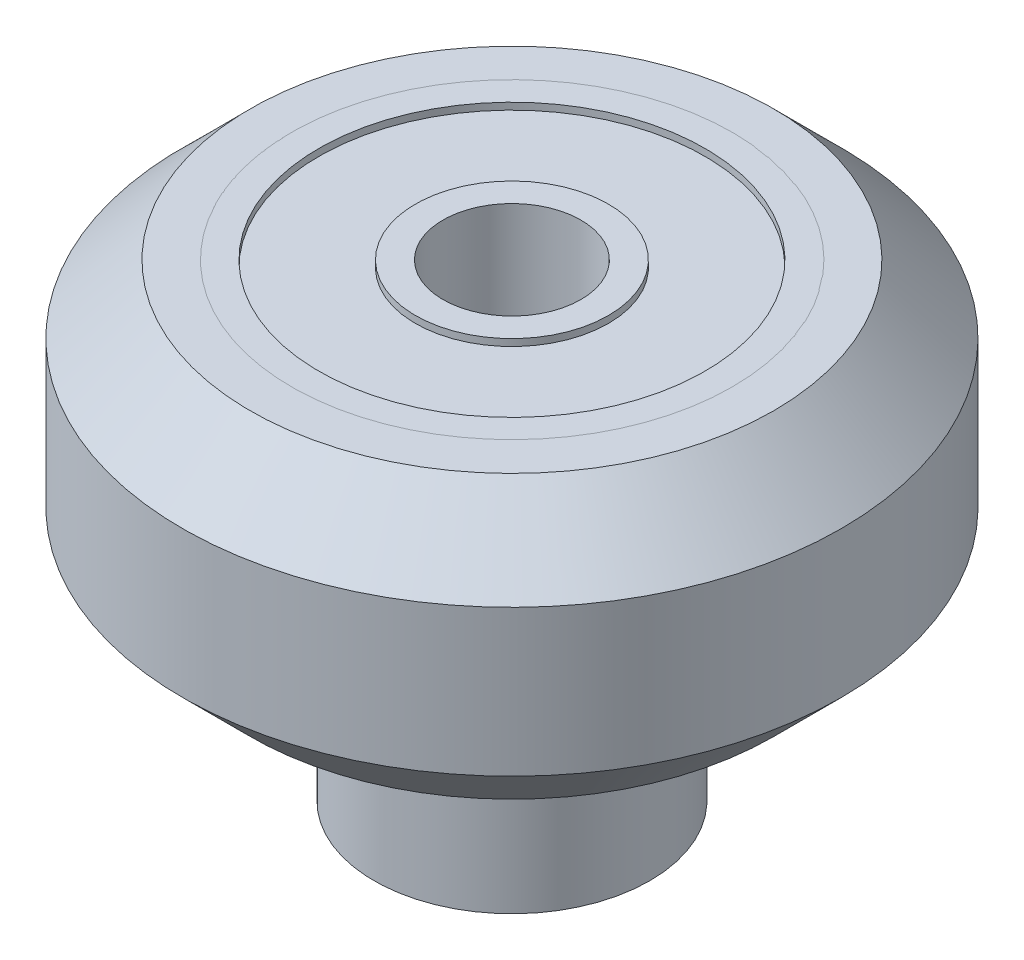
ISO-10303-21;
HEADER;
FILE_DESCRIPTION(('STEP AP214'),'2;1');
FILE_NAME('part.step','',(''),(''),'','','');
FILE_SCHEMA(('AUTOMOTIVE_DESIGN { 1 0 10303 214 1 1 1 1 }'));
ENDSEC;
DATA;
#1=APPLICATION_CONTEXT('core data for automotive mechanical design processes');
#2=APPLICATION_PROTOCOL_DEFINITION('international standard','automotive_design',2000,#1);
#3=PRODUCT_CONTEXT('',#1,'mechanical');
#4=PRODUCT('Part','Part','',(#3));
#5=PRODUCT_RELATED_PRODUCT_CATEGORY('part','',(#4));
#6=PRODUCT_DEFINITION_FORMATION('','',#4);
#7=PRODUCT_DEFINITION_CONTEXT('part definition',#1,'design');
#8=PRODUCT_DEFINITION('design','',#6,#7);
#9=PRODUCT_DEFINITION_SHAPE('','',#8);
#10=(LENGTH_UNIT() NAMED_UNIT(*) SI_UNIT(.MILLI.,.METRE.));
#11=(NAMED_UNIT(*) PLANE_ANGLE_UNIT() SI_UNIT($,.RADIAN.));
#12=(NAMED_UNIT(*) SI_UNIT($,.STERADIAN.) SOLID_ANGLE_UNIT());
#13=UNCERTAINTY_MEASURE_WITH_UNIT(LENGTH_MEASURE(1.E-05),#10,'distance_accuracy_value','');
#14=(GEOMETRIC_REPRESENTATION_CONTEXT(3) GLOBAL_UNCERTAINTY_ASSIGNED_CONTEXT((#13)) GLOBAL_UNIT_ASSIGNED_CONTEXT((#10,
#11,#12)) REPRESENTATION_CONTEXT('',''));
#15=CARTESIAN_POINT('',(0.,0.,0.));
#16=DIRECTION('',(0.,0.,1.));
#17=DIRECTION('',(1.,0.,0.));
#18=AXIS2_PLACEMENT_3D('',#15,#16,#17);
#19=CARTESIAN_POINT('',(-15.269501468331,-6.671026253248,2.998759293101));
#20=DIRECTION('',(0.,1.,0.));
#21=DIRECTION('',(-1.,0.,0.));
#22=AXIS2_PLACEMENT_3D('',#19,#20,#21);
#23=CYLINDRICAL_SURFACE('',#22,2.55);
#24=CARTESIAN_POINT('',(-15.269501468331,-12.671026253248,2.998759293101));
#25=DIRECTION('',(0.,1.,0.));
#26=DIRECTION('',(-1.,0.,0.));
#27=AXIS2_PLACEMENT_3D('',#24,#25,#26);
#28=CIRCLE('',#27,2.55);
#29=CARTESIAN_POINT('',(-12.719501468331,-12.671026253248,2.998759293101));
#30=VERTEX_POINT('',#29);
#31=EDGE_CURVE('P0_E31',#30,#30,#28,.T.);
#32=ORIENTED_EDGE('',*,*,#31,.F.);
#33=EDGE_LOOP('',(#32));
#34=FACE_BOUND('',#33,.T.);
#35=CARTESIAN_POINT('',(-15.269501468331,-6.671026253248,2.998759293101));
#36=DIRECTION('',(0.,-1.,0.));
#37=DIRECTION('',(-1.,0.,0.));
#38=AXIS2_PLACEMENT_3D('',#35,#36,#37);
#39=CIRCLE('',#38,2.55);
#40=CARTESIAN_POINT('',(-12.719501468331,-6.671026253248,2.998759293101));
#41=VERTEX_POINT('',#40);
#42=EDGE_CURVE('P0_E10',#41,#41,#39,.T.);
#43=ORIENTED_EDGE('',*,*,#42,.F.);
#44=EDGE_LOOP('',(#43));
#45=FACE_BOUND('',#44,.T.);
#46=ADVANCED_FACE('P0_F16',(#34,#45),#23,.F.);
#47=CARTESIAN_POINT('',(-15.269501468331,-6.671026253248,2.998759293101));
#48=DIRECTION('',(0.,1.,0.));
#49=DIRECTION('',(-1.,0.,0.));
#50=AXIS2_PLACEMENT_3D('',#47,#48,#49);
#51=CYLINDRICAL_SURFACE('',#50,5.);
#52=CARTESIAN_POINT('',(-15.269501468331,-12.671026253248,2.998759293101));
#53=DIRECTION('',(0.,-1.,0.));
#54=DIRECTION('',(-1.,0.,0.));
#55=AXIS2_PLACEMENT_3D('',#52,#53,#54);
#56=CIRCLE('',#55,5.);
#57=CARTESIAN_POINT('',(-10.269501468331,-12.671026253248,2.99875929310101));
#58=VERTEX_POINT('',#57);
#59=EDGE_CURVE('P0_E38',#58,#58,#56,.T.);
#60=ORIENTED_EDGE('',*,*,#59,.F.);
#61=EDGE_LOOP('',(#60));
#62=FACE_BOUND('',#61,.T.);
#63=CARTESIAN_POINT('',(-15.269501468331,-6.671026253248,2.998759293101));
#64=DIRECTION('',(0.,1.,0.));
#65=DIRECTION('',(-1.,0.,0.));
#66=AXIS2_PLACEMENT_3D('',#63,#64,#65);
#67=CIRCLE('',#66,5.);
#68=CARTESIAN_POINT('',(-10.269501468331,-6.671026253248,2.99875929310101));
#69=VERTEX_POINT('',#68);
#70=EDGE_CURVE('P0_E25',#69,#69,#67,.T.);
#71=ORIENTED_EDGE('',*,*,#70,.F.);
#72=EDGE_LOOP('',(#71));
#73=FACE_BOUND('',#72,.T.);
#74=ADVANCED_FACE('P0_F42',(#62,#73),#51,.T.);
#75=CARTESIAN_POINT('',(-15.269501468331,-6.671026253248,2.998759293101));
#76=DIRECTION('',(0.,-1.,0.));
#77=DIRECTION('',(1.,0.,0.));
#78=AXIS2_PLACEMENT_3D('',#75,#76,#77);
#79=PLANE('',#78);
#80=ORIENTED_EDGE('',*,*,#42,.T.);
#81=EDGE_LOOP('',(#80));
#82=FACE_BOUND('',#81,.T.);
#83=ORIENTED_EDGE('',*,*,#70,.T.);
#84=EDGE_LOOP('',(#83));
#85=FACE_BOUND('',#84,.T.);
#86=ADVANCED_FACE('P0_F18',(#82,#85),#79,.F.);
#87=CARTESIAN_POINT('',(-15.269501468331,-12.671026253248,2.998759293101));
#88=DIRECTION('',(0.,-1.,0.));
#89=DIRECTION('',(1.,0.,0.));
#90=AXIS2_PLACEMENT_3D('',#87,#88,#89);
#91=PLANE('',#90);
#92=ORIENTED_EDGE('',*,*,#31,.T.);
#93=EDGE_LOOP('',(#92));
#94=FACE_BOUND('',#93,.T.);
#95=ORIENTED_EDGE('',*,*,#59,.T.);
#96=EDGE_LOOP('',(#95));
#97=FACE_BOUND('',#96,.T.);
#98=ADVANCED_FACE('P0_F47',(#94,#97),#91,.T.);
#99=CLOSED_SHELL('',(#46,#74,#86,#98));
#100=MANIFOLD_SOLID_BREP('P0_B1',#99);
#101=CARTESIAN_POINT('',(-15.269501468331,-0.786026253248,2.998759293101));
#102=DIRECTION('',(0.,1.,0.));
#103=DIRECTION('',(1.,0.,0.));
#104=AXIS2_PLACEMENT_3D('',#101,#102,#103);
#105=CYLINDRICAL_SURFACE('',#104,7.987);
#106=CARTESIAN_POINT('',(-15.269501468331,-5.901026253248,2.998759293101));
#107=DIRECTION('',(0.,-1.,0.));
#108=DIRECTION('',(1.,0.,0.));
#109=AXIS2_PLACEMENT_3D('',#106,#107,#108);
#110=CIRCLE('',#109,7.987);
#111=CARTESIAN_POINT('',(-7.282501468331,-5.901026253248,2.998759293101));
#112=VERTEX_POINT('',#111);
#113=EDGE_CURVE('P1_E11',#112,#112,#110,.T.);
#114=ORIENTED_EDGE('',*,*,#113,.T.);
#115=EDGE_LOOP('',(#114));
#116=FACE_BOUND('',#115,.T.);
#117=CARTESIAN_POINT('',(-15.269501468331,4.328973746752,2.998759293101));
#118=DIRECTION('',(0.,-1.,0.));
#119=DIRECTION('',(1.,0.,0.));
#120=AXIS2_PLACEMENT_3D('',#117,#118,#119);
#121=CIRCLE('',#120,7.987);
#122=CARTESIAN_POINT('',(-7.282501468331,4.328973746752,2.998759293101));
#123=VERTEX_POINT('',#122);
#124=EDGE_CURVE('P1_E27',#123,#123,#121,.T.);
#125=ORIENTED_EDGE('',*,*,#124,.F.);
#126=EDGE_LOOP('',(#125));
#127=FACE_BOUND('',#126,.T.);
#128=ADVANCED_FACE('P1_F17',(#116,#127),#105,.F.);
#129=CARTESIAN_POINT('',(-5.782501468331,4.328973746752,2.998759293101));
#130=DIRECTION('',(0.,1.,0.));
#131=DIRECTION('',(0.,0.,1.));
#132=AXIS2_PLACEMENT_3D('',#129,#130,#131);
#133=PLANE('',#132);
#134=ORIENTED_EDGE('',*,*,#124,.T.);
#135=EDGE_LOOP('',(#134));
#136=FACE_BOUND('',#135,.T.);
#137=CARTESIAN_POINT('',(-15.269501468331,4.328973746752,2.998759293101));
#138=DIRECTION('',(0.,-1.,0.));
#139=DIRECTION('',(1.,0.,0.));
#140=AXIS2_PLACEMENT_3D('',#137,#138,#139);
#141=CIRCLE('',#140,9.487);
#142=CARTESIAN_POINT('',(-5.782501468331,4.328973746752,2.998759293101));
#143=VERTEX_POINT('',#142);
#144=EDGE_CURVE('P1_E50',#143,#143,#141,.T.);
#145=ORIENTED_EDGE('',*,*,#144,.F.);
#146=EDGE_LOOP('',(#145));
#147=FACE_BOUND('',#146,.T.);
#148=ADVANCED_FACE('P1_F61',(#136,#147),#133,.T.);
#149=CARTESIAN_POINT('',(-15.269501468331,3.097473746752,2.998759293101));
#150=DIRECTION('',(0.,-1.,0.));
#151=DIRECTION('',(1.,0.,0.));
#152=AXIS2_PLACEMENT_3D('',#149,#150,#151);
#153=CONICAL_SURFACE('',#152,10.7185,0.785398163397448);
#154=ORIENTED_EDGE('',*,*,#144,.T.);
#155=EDGE_LOOP('',(#154));
#156=FACE_BOUND('',#155,.T.);
#157=CARTESIAN_POINT('',(-15.269501468331,1.865973746752,2.998759293101));
#158=DIRECTION('',(0.,-1.,0.));
#159=DIRECTION('',(1.,0.,0.));
#160=AXIS2_PLACEMENT_3D('',#157,#158,#159);
#161=CIRCLE('',#160,11.95);
#162=CARTESIAN_POINT('',(-3.319501468331,1.865973746752,2.998759293101));
#163=VERTEX_POINT('',#162);
#164=EDGE_CURVE('P1_E48',#163,#163,#161,.T.);
#165=ORIENTED_EDGE('',*,*,#164,.F.);
#166=EDGE_LOOP('',(#165));
#167=FACE_BOUND('',#166,.T.);
#168=ADVANCED_FACE('P1_F19',(#156,#167),#153,.T.);
#169=CARTESIAN_POINT('',(-15.269501468331,-0.786026253248,2.998759293101));
#170=DIRECTION('',(0.,1.,0.));
#171=DIRECTION('',(1.,0.,0.));
#172=AXIS2_PLACEMENT_3D('',#169,#170,#171);
#173=CYLINDRICAL_SURFACE('',#172,11.95);
#174=ORIENTED_EDGE('',*,*,#164,.T.);
#175=EDGE_LOOP('',(#174));
#176=FACE_BOUND('',#175,.T.);
#177=CARTESIAN_POINT('',(-15.269501468331,-3.438026253248,2.998759293101));
#178=DIRECTION('',(0.,-1.,0.));
#179=DIRECTION('',(1.,0.,0.));
#180=AXIS2_PLACEMENT_3D('',#177,#178,#179);
#181=CIRCLE('',#180,11.95);
#182=CARTESIAN_POINT('',(-3.319501468331,-3.438026253248,2.998759293101));
#183=VERTEX_POINT('',#182);
#184=EDGE_CURVE('P1_E45',#183,#183,#181,.T.);
#185=ORIENTED_EDGE('',*,*,#184,.F.);
#186=EDGE_LOOP('',(#185));
#187=FACE_BOUND('',#186,.T.);
#188=ADVANCED_FACE('P1_F46',(#176,#187),#173,.T.);
#189=CARTESIAN_POINT('',(-15.269501468331,-4.669526253248,2.998759293101));
#190=DIRECTION('',(0.,1.,0.));
#191=DIRECTION('',(1.,0.,0.));
#192=AXIS2_PLACEMENT_3D('',#189,#190,#191);
#193=CONICAL_SURFACE('',#192,10.7185,0.785398163397448);
#194=ORIENTED_EDGE('',*,*,#184,.T.);
#195=EDGE_LOOP('',(#194));
#196=FACE_BOUND('',#195,.T.);
#197=CARTESIAN_POINT('',(-15.269501468331,-5.901026253248,2.998759293101));
#198=DIRECTION('',(0.,-1.,0.));
#199=DIRECTION('',(1.,0.,0.));
#200=AXIS2_PLACEMENT_3D('',#197,#198,#199);
#201=CIRCLE('',#200,9.487);
#202=CARTESIAN_POINT('',(-5.782501468331,-5.901026253248,2.998759293101));
#203=VERTEX_POINT('',#202);
#204=EDGE_CURVE('P1_E21',#203,#203,#201,.T.);
#205=ORIENTED_EDGE('',*,*,#204,.F.);
#206=EDGE_LOOP('',(#205));
#207=FACE_BOUND('',#206,.T.);
#208=ADVANCED_FACE('P1_F75',(#196,#207),#193,.T.);
#209=CARTESIAN_POINT('',(-7.282501468331,-5.901026253248,2.998759293101));
#210=DIRECTION('',(0.,-1.,0.));
#211=DIRECTION('',(0.,0.,-1.));
#212=AXIS2_PLACEMENT_3D('',#209,#210,#211);
#213=PLANE('',#212);
#214=ORIENTED_EDGE('',*,*,#204,.T.);
#215=EDGE_LOOP('',(#214));
#216=FACE_BOUND('',#215,.T.);
#217=ORIENTED_EDGE('',*,*,#113,.F.);
#218=EDGE_LOOP('',(#217));
#219=FACE_BOUND('',#218,.T.);
#220=ADVANCED_FACE('P1_F78',(#216,#219),#213,.T.);
#221=CLOSED_SHELL('',(#128,#148,#168,#188,#208,#220));
#222=MANIFOLD_SOLID_BREP('P1_B1',#221);
#223=CARTESIAN_POINT('',(-15.269501468331,-5.671026253248,2.998759293101));
#224=DIRECTION('',(0.,1.,0.));
#225=DIRECTION('',(-1.,0.,0.));
#226=AXIS2_PLACEMENT_3D('',#223,#224,#225);
#227=CYLINDRICAL_SURFACE('',#226,2.5);
#228=CARTESIAN_POINT('',(-15.269501468331,-6.671026253248,2.998759293101));
#229=DIRECTION('',(0.,1.,0.));
#230=DIRECTION('',(-1.,0.,0.));
#231=AXIS2_PLACEMENT_3D('',#228,#229,#230);
#232=CIRCLE('',#231,2.5);
#233=CARTESIAN_POINT('',(-12.769501468331,-6.671026253248,2.998759293101));
#234=VERTEX_POINT('',#233);
#235=EDGE_CURVE('P2_E32',#234,#234,#232,.T.);
#236=ORIENTED_EDGE('',*,*,#235,.F.);
#237=EDGE_LOOP('',(#236));
#238=FACE_BOUND('',#237,.T.);
#239=CARTESIAN_POINT('',(-15.269501468331,-5.671026253248,2.998759293101));
#240=DIRECTION('',(0.,-1.,0.));
#241=DIRECTION('',(-1.,0.,0.));
#242=AXIS2_PLACEMENT_3D('',#239,#240,#241);
#243=CIRCLE('',#242,2.5);
#244=CARTESIAN_POINT('',(-12.769501468331,-5.671026253248,2.998759293101));
#245=VERTEX_POINT('',#244);
#246=EDGE_CURVE('P2_E11',#245,#245,#243,.T.);
#247=ORIENTED_EDGE('',*,*,#246,.F.);
#248=EDGE_LOOP('',(#247));
#249=FACE_BOUND('',#248,.T.);
#250=ADVANCED_FACE('P2_F17',(#238,#249),#227,.F.);
#251=CARTESIAN_POINT('',(-15.269501468331,-5.671026253248,2.998759293101));
#252=DIRECTION('',(0.,1.,0.));
#253=DIRECTION('',(-1.,0.,0.));
#254=AXIS2_PLACEMENT_3D('',#251,#252,#253);
#255=CYLINDRICAL_SURFACE('',#254,5.);
#256=CARTESIAN_POINT('',(-15.269501468331,-6.671026253248,2.998759293101));
#257=DIRECTION('',(0.,-1.,0.));
#258=DIRECTION('',(-1.,0.,0.));
#259=AXIS2_PLACEMENT_3D('',#256,#257,#258);
#260=CIRCLE('',#259,5.);
#261=CARTESIAN_POINT('',(-10.269501468331,-6.671026253248,2.998759293101));
#262=VERTEX_POINT('',#261);
#263=EDGE_CURVE('P2_E39',#262,#262,#260,.T.);
#264=ORIENTED_EDGE('',*,*,#263,.F.);
#265=EDGE_LOOP('',(#264));
#266=FACE_BOUND('',#265,.T.);
#267=CARTESIAN_POINT('',(-15.269501468331,-5.671026253248,2.998759293101));
#268=DIRECTION('',(0.,1.,0.));
#269=DIRECTION('',(-1.,0.,0.));
#270=AXIS2_PLACEMENT_3D('',#267,#268,#269);
#271=CIRCLE('',#270,5.);
#272=CARTESIAN_POINT('',(-10.269501468331,-5.671026253248,2.998759293101));
#273=VERTEX_POINT('',#272);
#274=EDGE_CURVE('P2_E26',#273,#273,#271,.T.);
#275=ORIENTED_EDGE('',*,*,#274,.F.);
#276=EDGE_LOOP('',(#275));
#277=FACE_BOUND('',#276,.T.);
#278=ADVANCED_FACE('P2_F43',(#266,#277),#255,.T.);
#279=CARTESIAN_POINT('',(-15.269501468331,-5.671026253248,2.998759293101));
#280=DIRECTION('',(0.,-1.,0.));
#281=DIRECTION('',(1.,0.,0.));
#282=AXIS2_PLACEMENT_3D('',#279,#280,#281);
#283=PLANE('',#282);
#284=ORIENTED_EDGE('',*,*,#246,.T.);
#285=EDGE_LOOP('',(#284));
#286=FACE_BOUND('',#285,.T.);
#287=ORIENTED_EDGE('',*,*,#274,.T.);
#288=EDGE_LOOP('',(#287));
#289=FACE_BOUND('',#288,.T.);
#290=ADVANCED_FACE('P2_F19',(#286,#289),#283,.F.);
#291=CARTESIAN_POINT('',(-15.269501468331,-6.671026253248,2.998759293101));
#292=DIRECTION('',(0.,-1.,0.));
#293=DIRECTION('',(1.,0.,0.));
#294=AXIS2_PLACEMENT_3D('',#291,#292,#293);
#295=PLANE('',#294);
#296=ORIENTED_EDGE('',*,*,#235,.T.);
#297=EDGE_LOOP('',(#296));
#298=FACE_BOUND('',#297,.T.);
#299=ORIENTED_EDGE('',*,*,#263,.T.);
#300=EDGE_LOOP('',(#299));
#301=FACE_BOUND('',#300,.T.);
#302=ADVANCED_FACE('P2_F48',(#298,#301),#295,.T.);
#303=CLOSED_SHELL('',(#250,#278,#290,#302));
#304=MANIFOLD_SOLID_BREP('P2_B1',#303);
#305=CARTESIAN_POINT('',(-12.41701713586,4.328973746752,0.97062390979753));
#306=DIRECTION('',(0.,1.,0.));
#307=DIRECTION('',(0.57946725237242,0.,0.814995523563141));
#308=AXIS2_PLACEMENT_3D('',#305,#306,#307);
#309=PLANE('',#308);
#310=CARTESIAN_POINT('',(-15.269501468331,4.328973746752,2.998759293101));
#311=DIRECTION('',(0.,-1.,0.));
#312=DIRECTION('',(0.57946725237242,0.,0.814995523563141));
#313=AXIS2_PLACEMENT_3D('',#310,#311,#312);
#314=CIRCLE('',#313,3.5);
#315=CARTESIAN_POINT('',(-12.41701713586,4.328973746752,0.97062390979753));
#316=VERTEX_POINT('',#315);
#317=EDGE_CURVE('P3_E27',#316,#316,#314,.T.);
#318=ORIENTED_EDGE('',*,*,#317,.F.);
#319=EDGE_LOOP('',(#318));
#320=FACE_BOUND('',#319,.T.);
#321=CARTESIAN_POINT('',(-15.269501468331,4.328973746752,2.998759293101));
#322=DIRECTION('',(0.,-1.,0.));
#323=DIRECTION('',(0.57946725237242,0.,0.814995523563141));
#324=AXIS2_PLACEMENT_3D('',#321,#322,#323);
#325=CIRCLE('',#324,2.5);
#326=CARTESIAN_POINT('',(-13.2320126594231,4.328973746752,1.55009116216995));
#327=VERTEX_POINT('',#326);
#328=EDGE_CURVE('P3_E11',#327,#327,#325,.T.);
#329=ORIENTED_EDGE('',*,*,#328,.T.);
#330=EDGE_LOOP('',(#329));
#331=FACE_BOUND('',#330,.T.);
#332=ADVANCED_FACE('P3_F17',(#320,#331),#309,.T.);
#333=CARTESIAN_POINT('',(-15.269501468331,4.203973746752,2.998759293101));
#334=DIRECTION('',(0.,1.,0.));
#335=DIRECTION('',(0.814995523563141,0.,-0.57946725237242));
#336=AXIS2_PLACEMENT_3D('',#333,#334,#335);
#337=CYLINDRICAL_SURFACE('',#336,3.5);
#338=CARTESIAN_POINT('',(-15.269501468331,4.078973746752,2.998759293101));
#339=DIRECTION('',(0.,-1.,0.));
#340=DIRECTION('',(0.57946725237242,0.,0.814995523563141));
#341=AXIS2_PLACEMENT_3D('',#338,#339,#340);
#342=CIRCLE('',#341,3.5);
#343=CARTESIAN_POINT('',(-12.41701713586,4.078973746752,0.97062390979753));
#344=VERTEX_POINT('',#343);
#345=EDGE_CURVE('P3_E89',#344,#344,#342,.T.);
#346=ORIENTED_EDGE('',*,*,#345,.F.);
#347=EDGE_LOOP('',(#346));
#348=FACE_BOUND('',#347,.T.);
#349=ORIENTED_EDGE('',*,*,#317,.T.);
#350=EDGE_LOOP('',(#349));
#351=FACE_BOUND('',#350,.T.);
#352=ADVANCED_FACE('P3_F110',(#348,#351),#337,.T.);
#353=CARTESIAN_POINT('',(-9.56453280338901,4.078973746752,-1.05751147350594));
#354=DIRECTION('',(0.,1.,0.));
#355=DIRECTION('',(0.57946725237242,0.,0.814995523563141));
#356=AXIS2_PLACEMENT_3D('',#353,#354,#355);
#357=PLANE('',#356);
#358=CARTESIAN_POINT('',(-15.269501468331,4.078973746752,2.998759293101));
#359=DIRECTION('',(0.,-1.,0.));
#360=DIRECTION('',(0.57946725237242,0.,0.814995523563141));
#361=AXIS2_PLACEMENT_3D('',#358,#359,#360);
#362=CIRCLE('',#361,7.);
#363=CARTESIAN_POINT('',(-9.56453280338901,4.078973746752,-1.05751147350594));
#364=VERTEX_POINT('',#363);
#365=EDGE_CURVE('P3_E86',#364,#364,#362,.T.);
#366=ORIENTED_EDGE('',*,*,#365,.F.);
#367=EDGE_LOOP('',(#366));
#368=FACE_BOUND('',#367,.T.);
#369=ORIENTED_EDGE('',*,*,#345,.T.);
#370=EDGE_LOOP('',(#369));
#371=FACE_BOUND('',#370,.T.);
#372=ADVANCED_FACE('P3_F19',(#368,#371),#357,.T.);
#373=CARTESIAN_POINT('',(-15.269501468331,4.203973746752,2.998759293101));
#374=DIRECTION('',(0.,1.,0.));
#375=DIRECTION('',(0.814995523563141,0.,-0.57946725237242));
#376=AXIS2_PLACEMENT_3D('',#373,#374,#375);
#377=CYLINDRICAL_SURFACE('',#376,7.);
#378=CARTESIAN_POINT('',(-15.269501468331,4.328973746752,2.998759293101));
#379=DIRECTION('',(0.,-1.,0.));
#380=DIRECTION('',(0.57946725237242,0.,0.814995523563141));
#381=AXIS2_PLACEMENT_3D('',#378,#379,#380);
#382=CIRCLE('',#381,7.);
#383=CARTESIAN_POINT('',(-9.56453280338901,4.328973746752,-1.05751147350594));
#384=VERTEX_POINT('',#383);
#385=EDGE_CURVE('P3_E84',#384,#384,#382,.T.);
#386=ORIENTED_EDGE('',*,*,#385,.F.);
#387=EDGE_LOOP('',(#386));
#388=FACE_BOUND('',#387,.T.);
#389=ORIENTED_EDGE('',*,*,#365,.T.);
#390=EDGE_LOOP('',(#389));
#391=FACE_BOUND('',#390,.T.);
#392=ADVANCED_FACE('P3_F98',(#388,#391),#377,.F.);
#393=CARTESIAN_POINT('',(-8.74953727982587,4.328973746752,-1.63697872587836));
#394=DIRECTION('',(0.,1.,0.));
#395=DIRECTION('',(0.57946725237242,0.,0.814995523563141));
#396=AXIS2_PLACEMENT_3D('',#393,#394,#395);
#397=PLANE('',#396);
#398=CARTESIAN_POINT('',(-15.269501468331,4.328973746752,2.998759293101));
#399=DIRECTION('',(0.,-1.,0.));
#400=DIRECTION('',(0.57946725237242,0.,0.814995523563141));
#401=AXIS2_PLACEMENT_3D('',#398,#399,#400);
#402=CIRCLE('',#401,8.);
#403=CARTESIAN_POINT('',(-8.74953727982587,4.328973746752,-1.63697872587836));
#404=VERTEX_POINT('',#403);
#405=EDGE_CURVE('P3_E70',#404,#404,#402,.T.);
#406=ORIENTED_EDGE('',*,*,#405,.F.);
#407=EDGE_LOOP('',(#406));
#408=FACE_BOUND('',#407,.T.);
#409=ORIENTED_EDGE('',*,*,#385,.T.);
#410=EDGE_LOOP('',(#409));
#411=FACE_BOUND('',#410,.T.);
#412=ADVANCED_FACE('P3_F96',(#408,#411),#397,.T.);
#413=CARTESIAN_POINT('',(-15.269501468331,1.828973746752,2.998759293101));
#414=DIRECTION('',(0.,1.,0.));
#415=DIRECTION('',(0.814995523563141,0.,-0.57946725237242));
#416=AXIS2_PLACEMENT_3D('',#413,#414,#415);
#417=CYLINDRICAL_SURFACE('',#416,8.);
#418=CARTESIAN_POINT('',(-15.269501468331,-0.671026253247998,2.998759293101));
#419=DIRECTION('',(0.,-1.,0.));
#420=DIRECTION('',(0.57946725237242,0.,0.814995523563141));
#421=AXIS2_PLACEMENT_3D('',#418,#419,#420);
#422=CIRCLE('',#421,8.);
#423=CARTESIAN_POINT('',(-8.74953727982587,-0.671026253247998,-1.63697872587836));
#424=VERTEX_POINT('',#423);
#425=EDGE_CURVE('P3_E67',#424,#424,#422,.T.);
#426=ORIENTED_EDGE('',*,*,#425,.F.);
#427=EDGE_LOOP('',(#426));
#428=FACE_BOUND('',#427,.T.);
#429=ORIENTED_EDGE('',*,*,#405,.T.);
#430=EDGE_LOOP('',(#429));
#431=FACE_BOUND('',#430,.T.);
#432=ADVANCED_FACE('P3_F94',(#428,#431),#417,.T.);
#433=CARTESIAN_POINT('',(-9.56453280338901,-0.671026253247998,-1.05751147350594));
#434=DIRECTION('',(0.,-1.,0.));
#435=DIRECTION('',(-0.57946725237242,0.,-0.814995523563141));
#436=AXIS2_PLACEMENT_3D('',#433,#434,#435);
#437=PLANE('',#436);
#438=CARTESIAN_POINT('',(-15.269501468331,-0.671026253247998,2.998759293101));
#439=DIRECTION('',(0.,-1.,0.));
#440=DIRECTION('',(0.57946725237242,0.,0.814995523563141));
#441=AXIS2_PLACEMENT_3D('',#438,#439,#440);
#442=CIRCLE('',#441,7.);
#443=CARTESIAN_POINT('',(-9.56453280338901,-0.671026253247998,-1.05751147350594));
#444=VERTEX_POINT('',#443);
#445=EDGE_CURVE('P3_E21',#444,#444,#442,.T.);
#446=ORIENTED_EDGE('',*,*,#445,.F.);
#447=EDGE_LOOP('',(#446));
#448=FACE_BOUND('',#447,.T.);
#449=ORIENTED_EDGE('',*,*,#425,.T.);
#450=EDGE_LOOP('',(#449));
#451=FACE_BOUND('',#450,.T.);
#452=ADVANCED_FACE('P3_F64',(#448,#451),#437,.T.);
#453=CARTESIAN_POINT('',(-15.269501468331,-0.546026253247998,2.998759293101));
#454=DIRECTION('',(0.,1.,0.));
#455=DIRECTION('',(0.814995523563141,0.,-0.57946725237242));
#456=AXIS2_PLACEMENT_3D('',#453,#454,#455);
#457=CYLINDRICAL_SURFACE('',#456,7.);
#458=CARTESIAN_POINT('',(-15.269501468331,-0.421026253248,2.998759293101));
#459=DIRECTION('',(0.,-1.,0.));
#460=DIRECTION('',(0.57946725237242,0.,0.814995523563141));
#461=AXIS2_PLACEMENT_3D('',#458,#459,#460);
#462=CIRCLE('',#461,7.);
#463=CARTESIAN_POINT('',(-9.56453280338901,-0.421026253248,-1.05751147350594));
#464=VERTEX_POINT('',#463);
#465=EDGE_CURVE('P3_E68',#464,#464,#462,.T.);
#466=ORIENTED_EDGE('',*,*,#465,.F.);
#467=EDGE_LOOP('',(#466));
#468=FACE_BOUND('',#467,.T.);
#469=ORIENTED_EDGE('',*,*,#445,.T.);
#470=EDGE_LOOP('',(#469));
#471=FACE_BOUND('',#470,.T.);
#472=ADVANCED_FACE('P3_F125',(#468,#471),#457,.F.);
#473=CARTESIAN_POINT('',(-12.41701713586,-0.421026253248,0.97062390979753));
#474=DIRECTION('',(0.,-1.,0.));
#475=DIRECTION('',(-0.57946725237242,0.,-0.814995523563141));
#476=AXIS2_PLACEMENT_3D('',#473,#474,#475);
#477=PLANE('',#476);
#478=CARTESIAN_POINT('',(-15.269501468331,-0.421026253248,2.998759293101));
#479=DIRECTION('',(0.,-1.,0.));
#480=DIRECTION('',(0.57946725237242,0.,0.814995523563141));
#481=AXIS2_PLACEMENT_3D('',#478,#479,#480);
#482=CIRCLE('',#481,3.5);
#483=CARTESIAN_POINT('',(-12.41701713586,-0.421026253248,0.97062390979753));
#484=VERTEX_POINT('',#483);
#485=EDGE_CURVE('P3_E73',#484,#484,#482,.T.);
#486=ORIENTED_EDGE('',*,*,#485,.F.);
#487=EDGE_LOOP('',(#486));
#488=FACE_BOUND('',#487,.T.);
#489=ORIENTED_EDGE('',*,*,#465,.T.);
#490=EDGE_LOOP('',(#489));
#491=FACE_BOUND('',#490,.T.);
#492=ADVANCED_FACE('P3_F128',(#488,#491),#477,.T.);
#493=CARTESIAN_POINT('',(-15.269501468331,-0.546026253248,2.998759293101));
#494=DIRECTION('',(0.,1.,0.));
#495=DIRECTION('',(0.814995523563141,0.,-0.57946725237242));
#496=AXIS2_PLACEMENT_3D('',#493,#494,#495);
#497=CYLINDRICAL_SURFACE('',#496,3.5);
#498=CARTESIAN_POINT('',(-15.269501468331,-0.671026253247999,2.998759293101));
#499=DIRECTION('',(0.,-1.,0.));
#500=DIRECTION('',(0.57946725237242,0.,0.814995523563141));
#501=AXIS2_PLACEMENT_3D('',#498,#499,#500);
#502=CIRCLE('',#501,3.5);
#503=CARTESIAN_POINT('',(-12.41701713586,-0.671026253247999,0.97062390979753));
#504=VERTEX_POINT('',#503);
#505=EDGE_CURVE('P3_E77',#504,#504,#502,.T.);
#506=ORIENTED_EDGE('',*,*,#505,.F.);
#507=EDGE_LOOP('',(#506));
#508=FACE_BOUND('',#507,.T.);
#509=ORIENTED_EDGE('',*,*,#485,.T.);
#510=EDGE_LOOP('',(#509));
#511=FACE_BOUND('',#510,.T.);
#512=ADVANCED_FACE('P3_F133',(#508,#511),#497,.T.);
#513=CARTESIAN_POINT('',(-13.2320126594231,-0.671026253247999,1.55009116216995));
#514=DIRECTION('',(0.,-1.,0.));
#515=DIRECTION('',(-0.57946725237242,0.,-0.814995523563141));
#516=AXIS2_PLACEMENT_3D('',#513,#514,#515);
#517=PLANE('',#516);
#518=CARTESIAN_POINT('',(-15.269501468331,-0.671026253247999,2.998759293101));
#519=DIRECTION('',(0.,-1.,0.));
#520=DIRECTION('',(0.57946725237242,0.,0.814995523563141));
#521=AXIS2_PLACEMENT_3D('',#518,#519,#520);
#522=CIRCLE('',#521,2.5);
#523=CARTESIAN_POINT('',(-13.2320126594231,-0.671026253247999,1.55009116216995));
#524=VERTEX_POINT('',#523);
#525=EDGE_CURVE('P3_E82',#524,#524,#522,.T.);
#526=ORIENTED_EDGE('',*,*,#525,.F.);
#527=EDGE_LOOP('',(#526));
#528=FACE_BOUND('',#527,.T.);
#529=ORIENTED_EDGE('',*,*,#505,.T.);
#530=EDGE_LOOP('',(#529));
#531=FACE_BOUND('',#530,.T.);
#532=ADVANCED_FACE('P3_F122',(#528,#531),#517,.T.);
#533=CARTESIAN_POINT('',(-15.269501468331,1.828973746752,2.998759293101));
#534=DIRECTION('',(0.,1.,0.));
#535=DIRECTION('',(0.814995523563141,0.,-0.57946725237242));
#536=AXIS2_PLACEMENT_3D('',#533,#534,#535);
#537=CYLINDRICAL_SURFACE('',#536,2.5);
#538=ORIENTED_EDGE('',*,*,#328,.F.);
#539=EDGE_LOOP('',(#538));
#540=FACE_BOUND('',#539,.T.);
#541=ORIENTED_EDGE('',*,*,#525,.T.);
#542=EDGE_LOOP('',(#541));
#543=FACE_BOUND('',#542,.T.);
#544=ADVANCED_FACE('P3_F119',(#540,#543),#537,.F.);
#545=CLOSED_SHELL('',(#332,#352,#372,#392,#412,#432,#452,#472,#492,#512,#532,#544));
#546=MANIFOLD_SOLID_BREP('P3_B1',#545);
#547=CARTESIAN_POINT('',(-15.269501468331,-0.671026253248,-0.501240706899));
#548=DIRECTION('',(0.,1.,0.));
#549=DIRECTION('',(1.,0.,0.));
#550=AXIS2_PLACEMENT_3D('',#547,#548,#549);
#551=PLANE('',#550);
#552=CARTESIAN_POINT('',(-15.269501468331,-0.671026253248,2.998759293101));
#553=DIRECTION('',(0.,-1.,0.));
#554=DIRECTION('',(1.,0.,0.));
#555=AXIS2_PLACEMENT_3D('',#552,#553,#554);
#556=CIRCLE('',#555,3.5);
#557=CARTESIAN_POINT('',(-15.269501468331,-0.671026253248,-0.501240706899));
#558=VERTEX_POINT('',#557);
#559=EDGE_CURVE('P4_E27',#558,#558,#556,.T.);
#560=ORIENTED_EDGE('',*,*,#559,.F.);
#561=EDGE_LOOP('',(#560));
#562=FACE_BOUND('',#561,.T.);
#563=CARTESIAN_POINT('',(-15.269501468331,-0.671026253248,2.998759293101));
#564=DIRECTION('',(0.,-1.,0.));
#565=DIRECTION('',(1.,0.,0.));
#566=AXIS2_PLACEMENT_3D('',#563,#564,#565);
#567=CIRCLE('',#566,2.5);
#568=CARTESIAN_POINT('',(-15.269501468331,-0.671026253248,0.498759293101));
#569=VERTEX_POINT('',#568);
#570=EDGE_CURVE('P4_E11',#569,#569,#567,.T.);
#571=ORIENTED_EDGE('',*,*,#570,.T.);
#572=EDGE_LOOP('',(#571));
#573=FACE_BOUND('',#572,.T.);
#574=ADVANCED_FACE('P4_F17',(#562,#573),#551,.T.);
#575=CARTESIAN_POINT('',(-15.269501468331,-0.796026253248,2.998759293101));
#576=DIRECTION('',(0.,1.,0.));
#577=DIRECTION('',(0.,0.,-1.));
#578=AXIS2_PLACEMENT_3D('',#575,#576,#577);
#579=CYLINDRICAL_SURFACE('',#578,3.5);
#580=CARTESIAN_POINT('',(-15.269501468331,-0.921026253248,2.998759293101));
#581=DIRECTION('',(0.,-1.,0.));
#582=DIRECTION('',(1.,0.,0.));
#583=AXIS2_PLACEMENT_3D('',#580,#581,#582);
#584=CIRCLE('',#583,3.5);
#585=CARTESIAN_POINT('',(-15.269501468331,-0.921026253248,-0.501240706899));
#586=VERTEX_POINT('',#585);
#587=EDGE_CURVE('P4_E89',#586,#586,#584,.T.);
#588=ORIENTED_EDGE('',*,*,#587,.F.);
#589=EDGE_LOOP('',(#588));
#590=FACE_BOUND('',#589,.T.);
#591=ORIENTED_EDGE('',*,*,#559,.T.);
#592=EDGE_LOOP('',(#591));
#593=FACE_BOUND('',#592,.T.);
#594=ADVANCED_FACE('P4_F110',(#590,#593),#579,.T.);
#595=CARTESIAN_POINT('',(-15.269501468331,-0.921026253248,-4.001240706899));
#596=DIRECTION('',(0.,1.,0.));
#597=DIRECTION('',(1.,0.,0.));
#598=AXIS2_PLACEMENT_3D('',#595,#596,#597);
#599=PLANE('',#598);
#600=CARTESIAN_POINT('',(-15.269501468331,-0.921026253248,2.998759293101));
#601=DIRECTION('',(0.,-1.,0.));
#602=DIRECTION('',(1.,0.,0.));
#603=AXIS2_PLACEMENT_3D('',#600,#601,#602);
#604=CIRCLE('',#603,7.);
#605=CARTESIAN_POINT('',(-15.269501468331,-0.921026253248,-4.001240706899));
#606=VERTEX_POINT('',#605);
#607=EDGE_CURVE('P4_E86',#606,#606,#604,.T.);
#608=ORIENTED_EDGE('',*,*,#607,.F.);
#609=EDGE_LOOP('',(#608));
#610=FACE_BOUND('',#609,.T.);
#611=ORIENTED_EDGE('',*,*,#587,.T.);
#612=EDGE_LOOP('',(#611));
#613=FACE_BOUND('',#612,.T.);
#614=ADVANCED_FACE('P4_F19',(#610,#613),#599,.T.);
#615=CARTESIAN_POINT('',(-15.269501468331,-0.796026253248,2.998759293101));
#616=DIRECTION('',(0.,1.,0.));
#617=DIRECTION('',(0.,0.,-1.));
#618=AXIS2_PLACEMENT_3D('',#615,#616,#617);
#619=CYLINDRICAL_SURFACE('',#618,7.);
#620=CARTESIAN_POINT('',(-15.269501468331,-0.671026253248,2.998759293101));
#621=DIRECTION('',(0.,-1.,0.));
#622=DIRECTION('',(1.,0.,0.));
#623=AXIS2_PLACEMENT_3D('',#620,#621,#622);
#624=CIRCLE('',#623,7.);
#625=CARTESIAN_POINT('',(-15.269501468331,-0.671026253248,-4.001240706899));
#626=VERTEX_POINT('',#625);
#627=EDGE_CURVE('P4_E84',#626,#626,#624,.T.);
#628=ORIENTED_EDGE('',*,*,#627,.F.);
#629=EDGE_LOOP('',(#628));
#630=FACE_BOUND('',#629,.T.);
#631=ORIENTED_EDGE('',*,*,#607,.T.);
#632=EDGE_LOOP('',(#631));
#633=FACE_BOUND('',#632,.T.);
#634=ADVANCED_FACE('P4_F98',(#630,#633),#619,.F.);
#635=CARTESIAN_POINT('',(-15.269501468331,-0.671026253248,-5.001240706899));
#636=DIRECTION('',(0.,1.,0.));
#637=DIRECTION('',(1.,0.,0.));
#638=AXIS2_PLACEMENT_3D('',#635,#636,#637);
#639=PLANE('',#638);
#640=CARTESIAN_POINT('',(-15.269501468331,-0.671026253248,2.998759293101));
#641=DIRECTION('',(0.,-1.,0.));
#642=DIRECTION('',(1.,0.,0.));
#643=AXIS2_PLACEMENT_3D('',#640,#641,#642);
#644=CIRCLE('',#643,8.);
#645=CARTESIAN_POINT('',(-15.269501468331,-0.671026253248,-5.001240706899));
#646=VERTEX_POINT('',#645);
#647=EDGE_CURVE('P4_E70',#646,#646,#644,.T.);
#648=ORIENTED_EDGE('',*,*,#647,.F.);
#649=EDGE_LOOP('',(#648));
#650=FACE_BOUND('',#649,.T.);
#651=ORIENTED_EDGE('',*,*,#627,.T.);
#652=EDGE_LOOP('',(#651));
#653=FACE_BOUND('',#652,.T.);
#654=ADVANCED_FACE('P4_F96',(#650,#653),#639,.T.);
#655=CARTESIAN_POINT('',(-15.269501468331,-3.171026253248,2.998759293101));
#656=DIRECTION('',(0.,1.,0.));
#657=DIRECTION('',(0.,0.,-1.));
#658=AXIS2_PLACEMENT_3D('',#655,#656,#657);
#659=CYLINDRICAL_SURFACE('',#658,8.);
#660=CARTESIAN_POINT('',(-15.269501468331,-5.671026253248,2.998759293101));
#661=DIRECTION('',(0.,-1.,0.));
#662=DIRECTION('',(1.,0.,0.));
#663=AXIS2_PLACEMENT_3D('',#660,#661,#662);
#664=CIRCLE('',#663,8.);
#665=CARTESIAN_POINT('',(-15.269501468331,-5.671026253248,-5.001240706899));
#666=VERTEX_POINT('',#665);
#667=EDGE_CURVE('P4_E67',#666,#666,#664,.T.);
#668=ORIENTED_EDGE('',*,*,#667,.F.);
#669=EDGE_LOOP('',(#668));
#670=FACE_BOUND('',#669,.T.);
#671=ORIENTED_EDGE('',*,*,#647,.T.);
#672=EDGE_LOOP('',(#671));
#673=FACE_BOUND('',#672,.T.);
#674=ADVANCED_FACE('P4_F94',(#670,#673),#659,.T.);
#675=CARTESIAN_POINT('',(-15.269501468331,-5.671026253248,-4.001240706899));
#676=DIRECTION('',(0.,-1.,0.));
#677=DIRECTION('',(-1.,0.,0.));
#678=AXIS2_PLACEMENT_3D('',#675,#676,#677);
#679=PLANE('',#678);
#680=CARTESIAN_POINT('',(-15.269501468331,-5.671026253248,2.998759293101));
#681=DIRECTION('',(0.,-1.,0.));
#682=DIRECTION('',(1.,0.,0.));
#683=AXIS2_PLACEMENT_3D('',#680,#681,#682);
#684=CIRCLE('',#683,7.);
#685=CARTESIAN_POINT('',(-15.269501468331,-5.671026253248,-4.001240706899));
#686=VERTEX_POINT('',#685);
#687=EDGE_CURVE('P4_E21',#686,#686,#684,.T.);
#688=ORIENTED_EDGE('',*,*,#687,.F.);
#689=EDGE_LOOP('',(#688));
#690=FACE_BOUND('',#689,.T.);
#691=ORIENTED_EDGE('',*,*,#667,.T.);
#692=EDGE_LOOP('',(#691));
#693=FACE_BOUND('',#692,.T.);
#694=ADVANCED_FACE('P4_F64',(#690,#693),#679,.T.);
#695=CARTESIAN_POINT('',(-15.269501468331,-5.546026253248,2.998759293101));
#696=DIRECTION('',(0.,1.,0.));
#697=DIRECTION('',(0.,0.,-1.));
#698=AXIS2_PLACEMENT_3D('',#695,#696,#697);
#699=CYLINDRICAL_SURFACE('',#698,7.);
#700=CARTESIAN_POINT('',(-15.269501468331,-5.421026253248,2.998759293101));
#701=DIRECTION('',(0.,-1.,0.));
#702=DIRECTION('',(1.,0.,0.));
#703=AXIS2_PLACEMENT_3D('',#700,#701,#702);
#704=CIRCLE('',#703,7.);
#705=CARTESIAN_POINT('',(-15.269501468331,-5.421026253248,-4.001240706899));
#706=VERTEX_POINT('',#705);
#707=EDGE_CURVE('P4_E68',#706,#706,#704,.T.);
#708=ORIENTED_EDGE('',*,*,#707,.F.);
#709=EDGE_LOOP('',(#708));
#710=FACE_BOUND('',#709,.T.);
#711=ORIENTED_EDGE('',*,*,#687,.T.);
#712=EDGE_LOOP('',(#711));
#713=FACE_BOUND('',#712,.T.);
#714=ADVANCED_FACE('P4_F125',(#710,#713),#699,.F.);
#715=CARTESIAN_POINT('',(-15.269501468331,-5.421026253248,-0.501240706899));
#716=DIRECTION('',(0.,-1.,0.));
#717=DIRECTION('',(-1.,0.,0.));
#718=AXIS2_PLACEMENT_3D('',#715,#716,#717);
#719=PLANE('',#718);
#720=CARTESIAN_POINT('',(-15.269501468331,-5.421026253248,2.998759293101));
#721=DIRECTION('',(0.,-1.,0.));
#722=DIRECTION('',(1.,0.,0.));
#723=AXIS2_PLACEMENT_3D('',#720,#721,#722);
#724=CIRCLE('',#723,3.5);
#725=CARTESIAN_POINT('',(-15.269501468331,-5.421026253248,-0.501240706899));
#726=VERTEX_POINT('',#725);
#727=EDGE_CURVE('P4_E73',#726,#726,#724,.T.);
#728=ORIENTED_EDGE('',*,*,#727,.F.);
#729=EDGE_LOOP('',(#728));
#730=FACE_BOUND('',#729,.T.);
#731=ORIENTED_EDGE('',*,*,#707,.T.);
#732=EDGE_LOOP('',(#731));
#733=FACE_BOUND('',#732,.T.);
#734=ADVANCED_FACE('P4_F128',(#730,#733),#719,.T.);
#735=CARTESIAN_POINT('',(-15.269501468331,-5.546026253248,2.998759293101));
#736=DIRECTION('',(0.,1.,0.));
#737=DIRECTION('',(0.,0.,-1.));
#738=AXIS2_PLACEMENT_3D('',#735,#736,#737);
#739=CYLINDRICAL_SURFACE('',#738,3.5);
#740=CARTESIAN_POINT('',(-15.269501468331,-5.671026253248,2.998759293101));
#741=DIRECTION('',(0.,-1.,0.));
#742=DIRECTION('',(1.,0.,0.));
#743=AXIS2_PLACEMENT_3D('',#740,#741,#742);
#744=CIRCLE('',#743,3.5);
#745=CARTESIAN_POINT('',(-15.269501468331,-5.671026253248,-0.501240706899));
#746=VERTEX_POINT('',#745);
#747=EDGE_CURVE('P4_E77',#746,#746,#744,.T.);
#748=ORIENTED_EDGE('',*,*,#747,.F.);
#749=EDGE_LOOP('',(#748));
#750=FACE_BOUND('',#749,.T.);
#751=ORIENTED_EDGE('',*,*,#727,.T.);
#752=EDGE_LOOP('',(#751));
#753=FACE_BOUND('',#752,.T.);
#754=ADVANCED_FACE('P4_F133',(#750,#753),#739,.T.);
#755=CARTESIAN_POINT('',(-15.269501468331,-5.671026253248,0.498759293101));
#756=DIRECTION('',(0.,-1.,0.));
#757=DIRECTION('',(-1.,0.,0.));
#758=AXIS2_PLACEMENT_3D('',#755,#756,#757);
#759=PLANE('',#758);
#760=CARTESIAN_POINT('',(-15.269501468331,-5.671026253248,2.998759293101));
#761=DIRECTION('',(0.,-1.,0.));
#762=DIRECTION('',(1.,0.,0.));
#763=AXIS2_PLACEMENT_3D('',#760,#761,#762);
#764=CIRCLE('',#763,2.5);
#765=CARTESIAN_POINT('',(-15.269501468331,-5.671026253248,0.498759293101));
#766=VERTEX_POINT('',#765);
#767=EDGE_CURVE('P4_E82',#766,#766,#764,.T.);
#768=ORIENTED_EDGE('',*,*,#767,.F.);
#769=EDGE_LOOP('',(#768));
#770=FACE_BOUND('',#769,.T.);
#771=ORIENTED_EDGE('',*,*,#747,.T.);
#772=EDGE_LOOP('',(#771));
#773=FACE_BOUND('',#772,.T.);
#774=ADVANCED_FACE('P4_F122',(#770,#773),#759,.T.);
#775=CARTESIAN_POINT('',(-15.269501468331,-3.171026253248,2.998759293101));
#776=DIRECTION('',(0.,1.,0.));
#777=DIRECTION('',(0.,0.,-1.));
#778=AXIS2_PLACEMENT_3D('',#775,#776,#777);
#779=CYLINDRICAL_SURFACE('',#778,2.5);
#780=ORIENTED_EDGE('',*,*,#570,.F.);
#781=EDGE_LOOP('',(#780));
#782=FACE_BOUND('',#781,.T.);
#783=ORIENTED_EDGE('',*,*,#767,.T.);
#784=EDGE_LOOP('',(#783));
#785=FACE_BOUND('',#784,.T.);
#786=ADVANCED_FACE('P4_F119',(#782,#785),#779,.F.);
#787=CLOSED_SHELL('',(#574,#594,#614,#634,#654,#674,#694,#714,#734,#754,#774,#786));
#788=MANIFOLD_SOLID_BREP('P4_B1',#787);
#789=ADVANCED_BREP_SHAPE_REPRESENTATION('',(#18,#100,#222,#304,#546,#788),#14);
#790=SHAPE_DEFINITION_REPRESENTATION(#9,#789);
ENDSEC;
END-ISO-10303-21;
